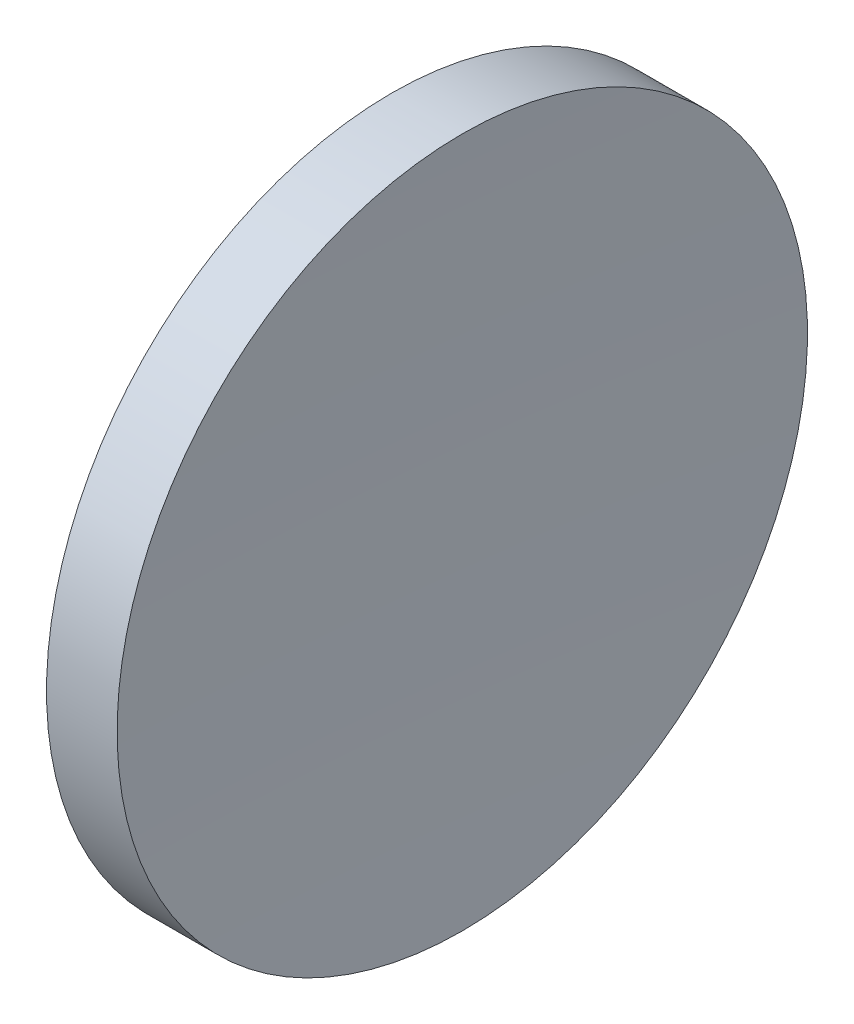
ISO-10303-21;
HEADER;
FILE_DESCRIPTION(('STEP AP214'),'2;1');
FILE_NAME('part.step','',(''),(''),'','','');
FILE_SCHEMA(('AUTOMOTIVE_DESIGN { 1 0 10303 214 1 1 1 1 }'));
ENDSEC;
DATA;
#1=APPLICATION_CONTEXT('core data for automotive mechanical design processes');
#2=APPLICATION_PROTOCOL_DEFINITION('international standard','automotive_design',2000,#1);
#3=PRODUCT_CONTEXT('',#1,'mechanical');
#4=PRODUCT('Part','Part','',(#3));
#5=PRODUCT_RELATED_PRODUCT_CATEGORY('part','',(#4));
#6=PRODUCT_DEFINITION_FORMATION('','',#4);
#7=PRODUCT_DEFINITION_CONTEXT('part definition',#1,'design');
#8=PRODUCT_DEFINITION('design','',#6,#7);
#9=PRODUCT_DEFINITION_SHAPE('','',#8);
#10=(LENGTH_UNIT() NAMED_UNIT(*) SI_UNIT(.MILLI.,.METRE.));
#11=(NAMED_UNIT(*) PLANE_ANGLE_UNIT() SI_UNIT($,.RADIAN.));
#12=(NAMED_UNIT(*) SI_UNIT($,.STERADIAN.) SOLID_ANGLE_UNIT());
#13=UNCERTAINTY_MEASURE_WITH_UNIT(LENGTH_MEASURE(1.E-05),#10,'distance_accuracy_value','');
#14=(GEOMETRIC_REPRESENTATION_CONTEXT(3) GLOBAL_UNCERTAINTY_ASSIGNED_CONTEXT((#13)) GLOBAL_UNIT_ASSIGNED_CONTEXT((#10,
#11,#12)) REPRESENTATION_CONTEXT('',''));
#15=CARTESIAN_POINT('',(0.,0.,0.));
#16=DIRECTION('',(0.,0.,1.));
#17=DIRECTION('',(1.,0.,0.));
#18=AXIS2_PLACEMENT_3D('',#15,#16,#17);
#19=CARTESIAN_POINT('',(430.012193698495,65.2168404709369,0.));
#20=DIRECTION('',(-1.,0.,0.));
#21=DIRECTION('',(0.,1.,0.));
#22=AXIS2_PLACEMENT_3D('',#19,#20,#21);
#23=SPHERICAL_SURFACE('',#22,304.4);
#24=CARTESIAN_POINT('',(125.868954418053,65.2168404709403,0.));
#25=DIRECTION('',(-1.,0.,0.));
#26=DIRECTION('',(0.,-1.,0.));
#27=AXIS2_PLACEMENT_3D('',#24,#25,#26);
#28=CIRCLE('',#27,12.5);
#29=CARTESIAN_POINT('',(125.868954418053,52.7168404709404,0.));
#30=VERTEX_POINT('',#29);
#31=EDGE_CURVE('E10',#30,#30,#28,.T.);
#32=ORIENTED_EDGE('',*,*,#31,.F.);
#33=EDGE_LOOP('',(#32));
#34=FACE_BOUND('',#33,.T.);
#35=ADVANCED_FACE('F35',(#34),#23,.F.);
#36=CARTESIAN_POINT('',(115.944491297963,65.2168404709403,0.));
#37=DIRECTION('',(-1.,0.,0.));
#38=DIRECTION('',(0.,-1.,0.));
#39=AXIS2_PLACEMENT_3D('',#36,#37,#38);
#40=CYLINDRICAL_SURFACE('',#39,12.5);
#41=CARTESIAN_POINT('',(123.311924157042,65.2168404709403,0.));
#42=DIRECTION('',(-1.,0.,0.));
#43=DIRECTION('',(0.,-1.,0.));
#44=AXIS2_PLACEMENT_3D('',#41,#42,#43);
#45=CIRCLE('',#44,12.5);
#46=CARTESIAN_POINT('',(123.311924157042,52.7168404709403,0.));
#47=VERTEX_POINT('',#46);
#48=EDGE_CURVE('E41',#47,#47,#45,.T.);
#49=ORIENTED_EDGE('',*,*,#48,.F.);
#50=EDGE_LOOP('',(#49));
#51=FACE_BOUND('',#50,.T.);
#52=ORIENTED_EDGE('',*,*,#31,.T.);
#53=EDGE_LOOP('',(#52));
#54=FACE_BOUND('',#53,.T.);
#55=ADVANCED_FACE('F49',(#51,#54),#40,.T.);
#56=CARTESIAN_POINT('',(234.612193698495,65.2168404709403,0.));
#57=DIRECTION('',(-1.,0.,0.));
#58=DIRECTION('',(0.,1.,0.));
#59=AXIS2_PLACEMENT_3D('',#56,#57,#58);
#60=SPHERICAL_SURFACE('',#59,112.);
#61=ORIENTED_EDGE('',*,*,#48,.T.);
#62=EDGE_LOOP('',(#61));
#63=FACE_BOUND('',#62,.T.);
#64=ADVANCED_FACE('F47',(#63),#60,.T.);
#65=CLOSED_SHELL('',(#35,#55,#64));
#66=MANIFOLD_SOLID_BREP('B2',#65);
#67=ADVANCED_BREP_SHAPE_REPRESENTATION('',(#18,#66),#14);
#68=SHAPE_DEFINITION_REPRESENTATION(#9,#67);
ENDSEC;
END-ISO-10303-21;
